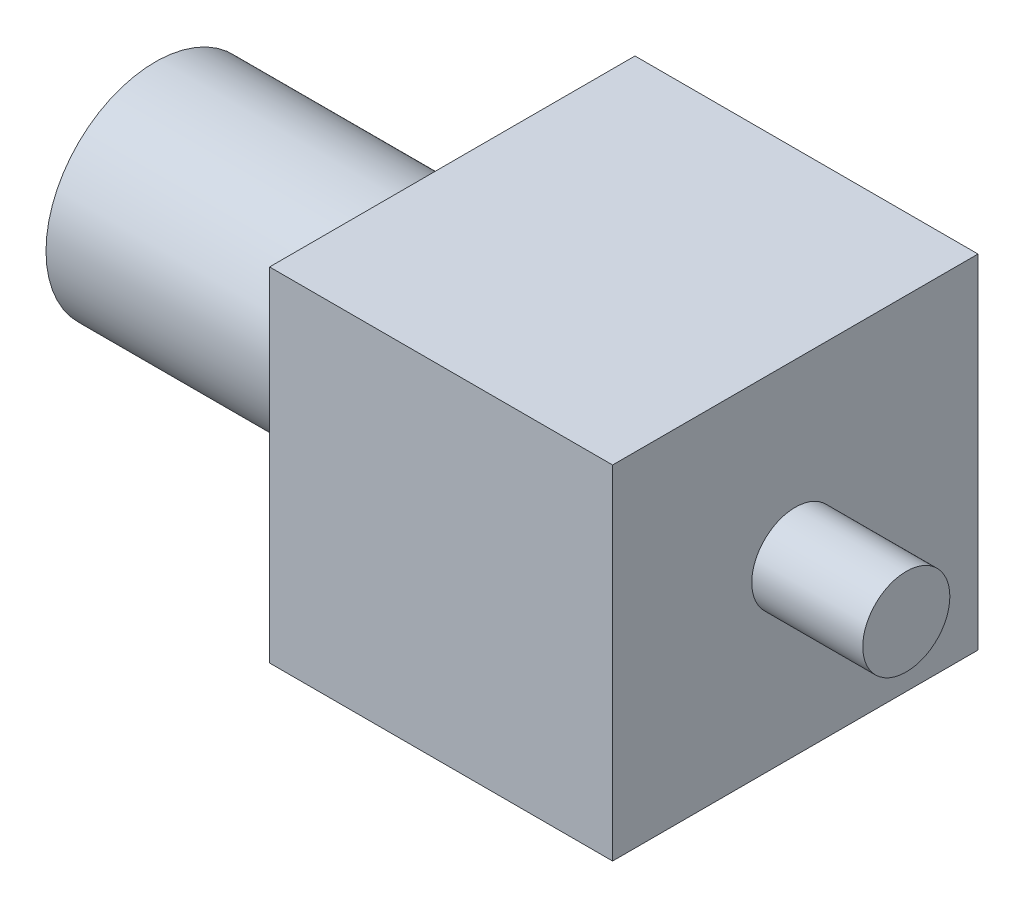
ISO-10303-21;
HEADER;
FILE_DESCRIPTION(('STEP AP214'),'2;1');
FILE_NAME('part.step','',(''),(''),'','','');
FILE_SCHEMA(('AUTOMOTIVE_DESIGN { 1 0 10303 214 1 1 1 1 }'));
ENDSEC;
DATA;
#1=APPLICATION_CONTEXT('core data for automotive mechanical design processes');
#2=APPLICATION_PROTOCOL_DEFINITION('international standard','automotive_design',2000,#1);
#3=PRODUCT_CONTEXT('',#1,'mechanical');
#4=PRODUCT('Part','Part','',(#3));
#5=PRODUCT_RELATED_PRODUCT_CATEGORY('part','',(#4));
#6=PRODUCT_DEFINITION_FORMATION('','',#4);
#7=PRODUCT_DEFINITION_CONTEXT('part definition',#1,'design');
#8=PRODUCT_DEFINITION('design','',#6,#7);
#9=PRODUCT_DEFINITION_SHAPE('','',#8);
#10=(LENGTH_UNIT() NAMED_UNIT(*) SI_UNIT(.MILLI.,.METRE.));
#11=(NAMED_UNIT(*) PLANE_ANGLE_UNIT() SI_UNIT($,.RADIAN.));
#12=(NAMED_UNIT(*) SI_UNIT($,.STERADIAN.) SOLID_ANGLE_UNIT());
#13=UNCERTAINTY_MEASURE_WITH_UNIT(LENGTH_MEASURE(1.E-05),#10,'distance_accuracy_value','');
#14=(GEOMETRIC_REPRESENTATION_CONTEXT(3) GLOBAL_UNCERTAINTY_ASSIGNED_CONTEXT((#13)) GLOBAL_UNIT_ASSIGNED_CONTEXT((#10,
#11,#12)) REPRESENTATION_CONTEXT('',''));
#15=CARTESIAN_POINT('',(0.,0.,0.));
#16=DIRECTION('',(0.,0.,1.));
#17=DIRECTION('',(1.,0.,0.));
#18=AXIS2_PLACEMENT_3D('',#15,#16,#17);
#19=CARTESIAN_POINT('',(0.,0.,26.6319));
#20=DIRECTION('',(1.,0.,0.));
#21=DIRECTION('',(0.,0.,-1.));
#22=AXIS2_PLACEMENT_3D('',#19,#20,#21);
#23=PLANE('',#22);
#24=CARTESIAN_POINT('',(0.,12.5,13.31595));
#25=DIRECTION('',(-1.,0.,0.));
#26=DIRECTION('',(0.,0.,1.));
#27=AXIS2_PLACEMENT_3D('',#24,#25,#26);
#28=CIRCLE('',#27,7.96925);
#29=CARTESIAN_POINT('',(0.,12.5,21.2852));
#30=VERTEX_POINT('',#29);
#31=EDGE_CURVE('E41',#30,#30,#28,.T.);
#32=ORIENTED_EDGE('',*,*,#31,.F.);
#33=EDGE_LOOP('',(#32));
#34=FACE_BOUND('',#33,.T.);
#35=DIRECTION('',(0.,-1.,0.));
#36=VECTOR('',#35,1.);
#37=CARTESIAN_POINT('',(0.,0.,0.));
#38=LINE('',#37,#36);
#39=CARTESIAN_POINT('',(0.,25.,0.));
#40=VERTEX_POINT('',#39);
#41=CARTESIAN_POINT('',(0.,0.,0.));
#42=VERTEX_POINT('',#41);
#43=EDGE_CURVE('E99',#40,#42,#38,.T.);
#44=ORIENTED_EDGE('',*,*,#43,.T.);
#45=DIRECTION('',(0.,0.,-1.));
#46=VECTOR('',#45,1.);
#47=CARTESIAN_POINT('',(0.,0.,26.6319));
#48=LINE('',#47,#46);
#49=CARTESIAN_POINT('',(0.,0.,26.6319));
#50=VERTEX_POINT('',#49);
#51=EDGE_CURVE('E35',#50,#42,#48,.T.);
#52=ORIENTED_EDGE('',*,*,#51,.F.);
#53=DIRECTION('',(0.,-1.,0.));
#54=VECTOR('',#53,1.);
#55=CARTESIAN_POINT('',(0.,0.,26.6319));
#56=LINE('',#55,#54);
#57=CARTESIAN_POINT('',(0.,25.,26.6319));
#58=VERTEX_POINT('',#57);
#59=EDGE_CURVE('E86',#58,#50,#56,.T.);
#60=ORIENTED_EDGE('',*,*,#59,.F.);
#61=DIRECTION('',(0.,0.,-1.));
#62=VECTOR('',#61,1.);
#63=CARTESIAN_POINT('',(0.,25.,26.6319));
#64=LINE('',#63,#62);
#65=EDGE_CURVE('E95',#58,#40,#64,.T.);
#66=ORIENTED_EDGE('',*,*,#65,.T.);
#67=EDGE_LOOP('',(#44,#52,#60,#66));
#68=FACE_BOUND('',#67,.T.);
#69=ADVANCED_FACE('F32',(#34,#68),#23,.F.);
#70=CARTESIAN_POINT('',(0.,0.,26.6319));
#71=DIRECTION('',(0.,1.,0.));
#72=DIRECTION('',(0.,0.,1.));
#73=AXIS2_PLACEMENT_3D('',#70,#71,#72);
#74=PLANE('',#73);
#75=DIRECTION('',(1.,0.,0.));
#76=VECTOR('',#75,1.);
#77=CARTESIAN_POINT('',(0.,0.,0.));
#78=LINE('',#77,#76);
#79=CARTESIAN_POINT('',(25.,0.,0.));
#80=VERTEX_POINT('',#79);
#81=EDGE_CURVE('E91',#42,#80,#78,.T.);
#82=ORIENTED_EDGE('',*,*,#81,.T.);
#83=DIRECTION('',(0.,0.,-1.));
#84=VECTOR('',#83,1.);
#85=CARTESIAN_POINT('',(25.,0.,26.6319));
#86=LINE('',#85,#84);
#87=CARTESIAN_POINT('',(25.,0.,26.6319));
#88=VERTEX_POINT('',#87);
#89=EDGE_CURVE('E89',#88,#80,#86,.T.);
#90=ORIENTED_EDGE('',*,*,#89,.F.);
#91=DIRECTION('',(1.,0.,0.));
#92=VECTOR('',#91,1.);
#93=CARTESIAN_POINT('',(0.,0.,26.6319));
#94=LINE('',#93,#92);
#95=EDGE_CURVE('E81',#50,#88,#94,.T.);
#96=ORIENTED_EDGE('',*,*,#95,.F.);
#97=ORIENTED_EDGE('',*,*,#51,.T.);
#98=EDGE_LOOP('',(#82,#90,#96,#97));
#99=FACE_BOUND('',#98,.T.);
#100=ADVANCED_FACE('F90',(#99),#74,.F.);
#101=CARTESIAN_POINT('',(25.,0.,26.6319));
#102=DIRECTION('',(-1.,0.,0.));
#103=DIRECTION('',(0.,0.,1.));
#104=AXIS2_PLACEMENT_3D('',#101,#102,#103);
#105=PLANE('',#104);
#106=CARTESIAN_POINT('',(25.,12.5,13.31595));
#107=DIRECTION('',(1.,0.,0.));
#108=DIRECTION('',(0.,0.,-1.));
#109=AXIS2_PLACEMENT_3D('',#106,#107,#108);
#110=CIRCLE('',#109,3.175);
#111=CARTESIAN_POINT('',(25.,12.5,10.14095));
#112=VERTEX_POINT('',#111);
#113=EDGE_CURVE('E11',#112,#112,#110,.T.);
#114=ORIENTED_EDGE('',*,*,#113,.F.);
#115=EDGE_LOOP('',(#114));
#116=FACE_BOUND('',#115,.T.);
#117=DIRECTION('',(0.,1.,0.));
#118=VECTOR('',#117,1.);
#119=CARTESIAN_POINT('',(25.,0.,0.));
#120=LINE('',#119,#118);
#121=CARTESIAN_POINT('',(25.,25.,0.));
#122=VERTEX_POINT('',#121);
#123=EDGE_CURVE('E67',#80,#122,#120,.T.);
#124=ORIENTED_EDGE('',*,*,#123,.T.);
#125=DIRECTION('',(0.,0.,-1.));
#126=VECTOR('',#125,1.);
#127=CARTESIAN_POINT('',(25.,25.,26.6319));
#128=LINE('',#127,#126);
#129=CARTESIAN_POINT('',(25.,25.,26.6319));
#130=VERTEX_POINT('',#129);
#131=EDGE_CURVE('E92',#130,#122,#128,.T.);
#132=ORIENTED_EDGE('',*,*,#131,.F.);
#133=DIRECTION('',(0.,1.,0.));
#134=VECTOR('',#133,1.);
#135=CARTESIAN_POINT('',(25.,0.,26.6319));
#136=LINE('',#135,#134);
#137=EDGE_CURVE('E84',#88,#130,#136,.T.);
#138=ORIENTED_EDGE('',*,*,#137,.F.);
#139=ORIENTED_EDGE('',*,*,#89,.T.);
#140=EDGE_LOOP('',(#124,#132,#138,#139));
#141=FACE_BOUND('',#140,.T.);
#142=ADVANCED_FACE('F93',(#116,#141),#105,.F.);
#143=CARTESIAN_POINT('',(0.,25.,26.6319));
#144=DIRECTION('',(0.,-1.,0.));
#145=DIRECTION('',(0.,0.,-1.));
#146=AXIS2_PLACEMENT_3D('',#143,#144,#145);
#147=PLANE('',#146);
#148=DIRECTION('',(-1.,0.,0.));
#149=VECTOR('',#148,1.);
#150=CARTESIAN_POINT('',(0.,25.,0.));
#151=LINE('',#150,#149);
#152=EDGE_CURVE('E73',#122,#40,#151,.T.);
#153=ORIENTED_EDGE('',*,*,#152,.T.);
#154=ORIENTED_EDGE('',*,*,#65,.F.);
#155=DIRECTION('',(-1.,0.,0.));
#156=VECTOR('',#155,1.);
#157=CARTESIAN_POINT('',(0.,25.,26.6319));
#158=LINE('',#157,#156);
#159=EDGE_CURVE('E50',#130,#58,#158,.T.);
#160=ORIENTED_EDGE('',*,*,#159,.F.);
#161=ORIENTED_EDGE('',*,*,#131,.T.);
#162=EDGE_LOOP('',(#153,#154,#160,#161));
#163=FACE_BOUND('',#162,.T.);
#164=ADVANCED_FACE('F107',(#163),#147,.F.);
#165=CARTESIAN_POINT('',(0.,0.,26.6319));
#166=DIRECTION('',(0.,0.,-1.));
#167=DIRECTION('',(-1.,0.,0.));
#168=AXIS2_PLACEMENT_3D('',#165,#166,#167);
#169=PLANE('',#168);
#170=ORIENTED_EDGE('',*,*,#59,.T.);
#171=ORIENTED_EDGE('',*,*,#95,.T.);
#172=ORIENTED_EDGE('',*,*,#137,.T.);
#173=ORIENTED_EDGE('',*,*,#159,.T.);
#174=EDGE_LOOP('',(#170,#171,#172,#173));
#175=FACE_BOUND('',#174,.T.);
#176=ADVANCED_FACE('F82',(#175),#169,.F.);
#177=CARTESIAN_POINT('',(0.,0.,0.));
#178=DIRECTION('',(0.,0.,-1.));
#179=DIRECTION('',(-1.,0.,0.));
#180=AXIS2_PLACEMENT_3D('',#177,#178,#179);
#181=PLANE('',#180);
#182=ORIENTED_EDGE('',*,*,#43,.F.);
#183=ORIENTED_EDGE('',*,*,#152,.F.);
#184=ORIENTED_EDGE('',*,*,#123,.F.);
#185=ORIENTED_EDGE('',*,*,#81,.F.);
#186=EDGE_LOOP('',(#182,#183,#184,#185));
#187=FACE_BOUND('',#186,.T.);
#188=ADVANCED_FACE('F110',(#187),#181,.T.);
#189=CARTESIAN_POINT('',(-21.6408,12.5,13.31595));
#190=DIRECTION('',(1.,0.,0.));
#191=DIRECTION('',(0.,0.,-1.));
#192=AXIS2_PLACEMENT_3D('',#189,#190,#191);
#193=CYLINDRICAL_SURFACE('',#192,7.96925);
#194=CARTESIAN_POINT('',(-21.6408,12.5,13.31595));
#195=DIRECTION('',(-1.,0.,0.));
#196=DIRECTION('',(0.,0.,1.));
#197=AXIS2_PLACEMENT_3D('',#194,#195,#196);
#198=CIRCLE('',#197,7.96925);
#199=CARTESIAN_POINT('',(-21.6408,12.5,21.2852));
#200=VERTEX_POINT('',#199);
#201=EDGE_CURVE('E102',#200,#200,#198,.T.);
#202=ORIENTED_EDGE('',*,*,#201,.F.);
#203=EDGE_LOOP('',(#202));
#204=FACE_BOUND('',#203,.T.);
#205=ORIENTED_EDGE('',*,*,#31,.T.);
#206=EDGE_LOOP('',(#205));
#207=FACE_BOUND('',#206,.T.);
#208=ADVANCED_FACE('F143',(#204,#207),#193,.T.);
#209=CARTESIAN_POINT('',(-21.6408,12.5,13.31595));
#210=DIRECTION('',(-1.,0.,0.));
#211=DIRECTION('',(0.,0.,1.));
#212=AXIS2_PLACEMENT_3D('',#209,#210,#211);
#213=PLANE('',#212);
#214=ORIENTED_EDGE('',*,*,#201,.T.);
#215=EDGE_LOOP('',(#214));
#216=FACE_BOUND('',#215,.T.);
#217=ADVANCED_FACE('F126',(#216),#213,.T.);
#218=CARTESIAN_POINT('',(33.0899,12.5,13.31595));
#219=DIRECTION('',(-1.,0.,0.));
#220=DIRECTION('',(0.,0.,1.));
#221=AXIS2_PLACEMENT_3D('',#218,#219,#220);
#222=CYLINDRICAL_SURFACE('',#221,3.175);
#223=CARTESIAN_POINT('',(33.0899,12.5,13.31595));
#224=DIRECTION('',(1.,0.,0.));
#225=DIRECTION('',(0.,0.,-1.));
#226=AXIS2_PLACEMENT_3D('',#223,#224,#225);
#227=CIRCLE('',#226,3.175);
#228=CARTESIAN_POINT('',(33.0899,12.5,10.14095));
#229=VERTEX_POINT('',#228);
#230=EDGE_CURVE('E116',#229,#229,#227,.T.);
#231=ORIENTED_EDGE('',*,*,#230,.F.);
#232=EDGE_LOOP('',(#231));
#233=FACE_BOUND('',#232,.T.);
#234=ORIENTED_EDGE('',*,*,#113,.T.);
#235=EDGE_LOOP('',(#234));
#236=FACE_BOUND('',#235,.T.);
#237=ADVANCED_FACE('F123',(#233,#236),#222,.T.);
#238=CARTESIAN_POINT('',(33.0899,12.5,13.31595));
#239=DIRECTION('',(1.,0.,0.));
#240=DIRECTION('',(0.,0.,-1.));
#241=AXIS2_PLACEMENT_3D('',#238,#239,#240);
#242=PLANE('',#241);
#243=ORIENTED_EDGE('',*,*,#230,.T.);
#244=EDGE_LOOP('',(#243));
#245=FACE_BOUND('',#244,.T.);
#246=ADVANCED_FACE('F121',(#245),#242,.T.);
#247=CLOSED_SHELL('',(#69,#100,#142,#164,#176,#188,#208,#217,#237,#246));
#248=MANIFOLD_SOLID_BREP('B2',#247);
#249=ADVANCED_BREP_SHAPE_REPRESENTATION('',(#18,#248),#14);
#250=SHAPE_DEFINITION_REPRESENTATION(#9,#249);
ENDSEC;
END-ISO-10303-21;
